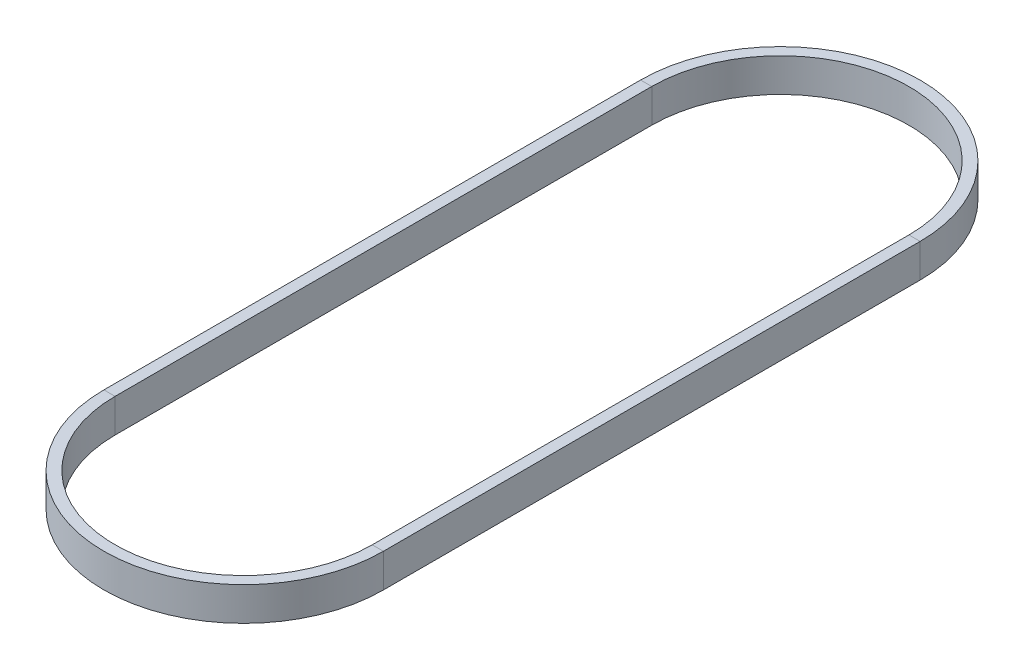
ISO-10303-21;
HEADER;
FILE_DESCRIPTION(('STEP AP214'),'2;1');
FILE_NAME('part.step','',(''),(''),'','','');
FILE_SCHEMA(('AUTOMOTIVE_DESIGN { 1 0 10303 214 1 1 1 1 }'));
ENDSEC;
DATA;
#1=APPLICATION_CONTEXT('core data for automotive mechanical design processes');
#2=APPLICATION_PROTOCOL_DEFINITION('international standard','automotive_design',2000,#1);
#3=PRODUCT_CONTEXT('',#1,'mechanical');
#4=PRODUCT('Part','Part','',(#3));
#5=PRODUCT_RELATED_PRODUCT_CATEGORY('part','',(#4));
#6=PRODUCT_DEFINITION_FORMATION('','',#4);
#7=PRODUCT_DEFINITION_CONTEXT('part definition',#1,'design');
#8=PRODUCT_DEFINITION('design','',#6,#7);
#9=PRODUCT_DEFINITION_SHAPE('','',#8);
#10=(LENGTH_UNIT() NAMED_UNIT(*) SI_UNIT(.MILLI.,.METRE.));
#11=(NAMED_UNIT(*) PLANE_ANGLE_UNIT() SI_UNIT($,.RADIAN.));
#12=(NAMED_UNIT(*) SI_UNIT($,.STERADIAN.) SOLID_ANGLE_UNIT());
#13=UNCERTAINTY_MEASURE_WITH_UNIT(LENGTH_MEASURE(1.E-05),#10,'distance_accuracy_value','');
#14=(GEOMETRIC_REPRESENTATION_CONTEXT(3) GLOBAL_UNCERTAINTY_ASSIGNED_CONTEXT((#13)) GLOBAL_UNIT_ASSIGNED_CONTEXT((#10,
#11,#12)) REPRESENTATION_CONTEXT('',''));
#15=CARTESIAN_POINT('',(0.,0.,0.));
#16=DIRECTION('',(0.,0.,1.));
#17=DIRECTION('',(1.,0.,0.));
#18=AXIS2_PLACEMENT_3D('',#15,#16,#17);
#19=CARTESIAN_POINT('',(740.522377582775,3.,330.011074688203));
#20=DIRECTION('',(0.,1.,0.));
#21=DIRECTION('',(0.,0.,1.));
#22=AXIS2_PLACEMENT_3D('',#19,#20,#21);
#23=PLANE('',#22);
#24=DIRECTION('',(0.,0.,-1.));
#25=VECTOR('',#24,1.);
#26=CARTESIAN_POINT('',(738.522377582775,3.,330.011074688203));
#27=LINE('',#26,#25);
#28=CARTESIAN_POINT('',(738.522377582775,3.,330.0110746882));
#29=VERTEX_POINT('',#28);
#30=CARTESIAN_POINT('',(738.522377582775,3.,234.011074688204));
#31=VERTEX_POINT('',#30);
#32=EDGE_CURVE('E11',#29,#31,#27,.T.);
#33=ORIENTED_EDGE('',*,*,#32,.F.);
#34=DIRECTION('',(1.,0.,0.));
#35=VECTOR('',#34,1.);
#36=CARTESIAN_POINT('',(740.522377582776,3.,330.0110746882));
#37=LINE('',#36,#35);
#38=CARTESIAN_POINT('',(740.522377582775,3.,330.0110746882));
#39=VERTEX_POINT('',#38);
#40=EDGE_CURVE('E42',#29,#39,#37,.T.);
#41=ORIENTED_EDGE('',*,*,#40,.T.);
#42=DIRECTION('',(0.,0.,-1.));
#43=VECTOR('',#42,1.);
#44=CARTESIAN_POINT('',(740.522377582775,3.,330.011074688203));
#45=LINE('',#44,#43);
#46=CARTESIAN_POINT('',(740.522377582775,3.,234.011074688204));
#47=VERTEX_POINT('',#46);
#48=EDGE_CURVE('E128',#39,#47,#45,.T.);
#49=ORIENTED_EDGE('',*,*,#48,.T.);
#50=DIRECTION('',(1.,0.,0.));
#51=VECTOR('',#50,1.);
#52=CARTESIAN_POINT('',(740.522377582775,3.,234.011074688204));
#53=LINE('',#52,#51);
#54=EDGE_CURVE('E131',#31,#47,#53,.T.);
#55=ORIENTED_EDGE('',*,*,#54,.F.);
#56=EDGE_LOOP('',(#33,#41,#49,#55));
#57=FACE_BOUND('',#56,.T.);
#58=ADVANCED_FACE('F39',(#57),#23,.T.);
#59=CARTESIAN_POINT('',(738.522377582775,3.,330.011074688203));
#60=DIRECTION('',(-1.,0.,0.));
#61=DIRECTION('',(0.,0.,1.));
#62=AXIS2_PLACEMENT_3D('',#59,#60,#61);
#63=PLANE('',#62);
#64=DIRECTION('',(0.,0.,-1.));
#65=VECTOR('',#64,1.);
#66=CARTESIAN_POINT('',(738.522377582775,-3.,330.011074688203));
#67=LINE('',#66,#65);
#68=CARTESIAN_POINT('',(738.522377582775,-3.,330.0110746882));
#69=VERTEX_POINT('',#68);
#70=CARTESIAN_POINT('',(738.522377582775,-3.,234.011074688204));
#71=VERTEX_POINT('',#70);
#72=EDGE_CURVE('E48',#69,#71,#67,.T.);
#73=ORIENTED_EDGE('',*,*,#72,.F.);
#74=DIRECTION('',(0.,1.,0.));
#75=VECTOR('',#74,1.);
#76=CARTESIAN_POINT('',(738.522377582776,3.,330.0110746882));
#77=LINE('',#76,#75);
#78=EDGE_CURVE('E218',#69,#29,#77,.T.);
#79=ORIENTED_EDGE('',*,*,#78,.T.);
#80=ORIENTED_EDGE('',*,*,#32,.T.);
#81=DIRECTION('',(0.,1.,0.));
#82=VECTOR('',#81,1.);
#83=CARTESIAN_POINT('',(738.522377582775,3.,234.011074688204));
#84=LINE('',#83,#82);
#85=EDGE_CURVE('E159',#71,#31,#84,.T.);
#86=ORIENTED_EDGE('',*,*,#85,.F.);
#87=EDGE_LOOP('',(#73,#79,#80,#86));
#88=FACE_BOUND('',#87,.T.);
#89=ADVANCED_FACE('F252',(#88),#63,.T.);
#90=CARTESIAN_POINT('',(740.522377582775,-3.,330.011074688203));
#91=DIRECTION('',(0.,-1.,0.));
#92=DIRECTION('',(0.,0.,-1.));
#93=AXIS2_PLACEMENT_3D('',#90,#91,#92);
#94=PLANE('',#93);
#95=DIRECTION('',(0.,0.,-1.));
#96=VECTOR('',#95,1.);
#97=CARTESIAN_POINT('',(740.522377582775,-3.,330.011074688203));
#98=LINE('',#97,#96);
#99=CARTESIAN_POINT('',(740.522377582775,-3.,330.0110746882));
#100=VERTEX_POINT('',#99);
#101=CARTESIAN_POINT('',(740.522377582775,-3.,234.011074688204));
#102=VERTEX_POINT('',#101);
#103=EDGE_CURVE('E138',#100,#102,#98,.T.);
#104=ORIENTED_EDGE('',*,*,#103,.F.);
#105=DIRECTION('',(-1.,0.,0.));
#106=VECTOR('',#105,1.);
#107=CARTESIAN_POINT('',(740.522377582776,-3.,330.0110746882));
#108=LINE('',#107,#106);
#109=EDGE_CURVE('E194',#100,#69,#108,.T.);
#110=ORIENTED_EDGE('',*,*,#109,.T.);
#111=ORIENTED_EDGE('',*,*,#72,.T.);
#112=DIRECTION('',(-1.,0.,0.));
#113=VECTOR('',#112,1.);
#114=CARTESIAN_POINT('',(740.522377582775,-3.,234.011074688204));
#115=LINE('',#114,#113);
#116=EDGE_CURVE('E164',#102,#71,#115,.T.);
#117=ORIENTED_EDGE('',*,*,#116,.F.);
#118=EDGE_LOOP('',(#104,#110,#111,#117));
#119=FACE_BOUND('',#118,.T.);
#120=ADVANCED_FACE('F257',(#119),#94,.T.);
#121=CARTESIAN_POINT('',(786.522377582775,3.,330.011074688204));
#122=DIRECTION('',(0.,1.,0.));
#123=DIRECTION('',(0.,0.,1.));
#124=AXIS2_PLACEMENT_3D('',#121,#122,#123);
#125=PLANE('',#124);
#126=ORIENTED_EDGE('',*,*,#40,.F.);
#127=CARTESIAN_POINT('',(763.522377582775,3.,330.011074688204));
#128=DIRECTION('',(0.,-1.,0.));
#129=DIRECTION('',(1.,0.,0.));
#130=AXIS2_PLACEMENT_3D('',#127,#128,#129);
#131=CIRCLE('',#130,25.0000000000001);
#132=CARTESIAN_POINT('',(788.522377582775,3.,330.011074688204));
#133=VERTEX_POINT('',#132);
#134=EDGE_CURVE('E84',#133,#29,#131,.T.);
#135=ORIENTED_EDGE('',*,*,#134,.F.);
#136=DIRECTION('',(-1.,0.,0.));
#137=VECTOR('',#136,1.);
#138=CARTESIAN_POINT('',(786.522377582775,3.,330.011074688204));
#139=LINE('',#138,#137);
#140=CARTESIAN_POINT('',(786.522377582775,3.,330.011074688204));
#141=VERTEX_POINT('',#140);
#142=EDGE_CURVE('E198',#133,#141,#139,.T.);
#143=ORIENTED_EDGE('',*,*,#142,.T.);
#144=CARTESIAN_POINT('',(763.522377582775,3.,330.011074688204));
#145=DIRECTION('',(0.,-1.,0.));
#146=DIRECTION('',(1.,0.,0.));
#147=AXIS2_PLACEMENT_3D('',#144,#145,#146);
#148=CIRCLE('',#147,23.0000000000001);
#149=EDGE_CURVE('E191',#141,#39,#148,.T.);
#150=ORIENTED_EDGE('',*,*,#149,.T.);
#151=EDGE_LOOP('',(#126,#135,#143,#150));
#152=FACE_BOUND('',#151,.T.);
#153=ADVANCED_FACE('F241',(#152),#125,.T.);
#154=CARTESIAN_POINT('',(763.522377582775,0.,330.011074688204));
#155=DIRECTION('',(0.,-1.,0.));
#156=DIRECTION('',(0.,0.,-1.));
#157=AXIS2_PLACEMENT_3D('',#154,#155,#156);
#158=CYLINDRICAL_SURFACE('',#157,25.0000000000001);
#159=ORIENTED_EDGE('',*,*,#134,.T.);
#160=ORIENTED_EDGE('',*,*,#78,.F.);
#161=CARTESIAN_POINT('',(763.522377582775,-3.,330.011074688204));
#162=DIRECTION('',(0.,-1.,0.));
#163=DIRECTION('',(1.,0.,0.));
#164=AXIS2_PLACEMENT_3D('',#161,#162,#163);
#165=CIRCLE('',#164,25.0000000000001);
#166=CARTESIAN_POINT('',(788.522377582775,-3.,330.011074688204));
#167=VERTEX_POINT('',#166);
#168=EDGE_CURVE('E93',#167,#69,#165,.T.);
#169=ORIENTED_EDGE('',*,*,#168,.F.);
#170=DIRECTION('',(0.,1.,0.));
#171=VECTOR('',#170,1.);
#172=CARTESIAN_POINT('',(788.522377582775,3.,330.011074688204));
#173=LINE('',#172,#171);
#174=EDGE_CURVE('E212',#167,#133,#173,.T.);
#175=ORIENTED_EDGE('',*,*,#174,.T.);
#176=EDGE_LOOP('',(#159,#160,#169,#175));
#177=FACE_BOUND('',#176,.T.);
#178=ADVANCED_FACE('F251',(#177),#158,.T.);
#179=CARTESIAN_POINT('',(786.522377582775,-3.,330.011074688204));
#180=DIRECTION('',(0.,-1.,0.));
#181=DIRECTION('',(0.,0.,-1.));
#182=AXIS2_PLACEMENT_3D('',#179,#180,#181);
#183=PLANE('',#182);
#184=ORIENTED_EDGE('',*,*,#168,.T.);
#185=ORIENTED_EDGE('',*,*,#109,.F.);
#186=CARTESIAN_POINT('',(763.522377582775,-3.,330.011074688204));
#187=DIRECTION('',(0.,-1.,0.));
#188=DIRECTION('',(1.,0.,0.));
#189=AXIS2_PLACEMENT_3D('',#186,#187,#188);
#190=CIRCLE('',#189,23.0000000000001);
#191=CARTESIAN_POINT('',(786.522377582775,-3.,330.011074688204));
#192=VERTEX_POINT('',#191);
#193=EDGE_CURVE('E101',#192,#100,#190,.T.);
#194=ORIENTED_EDGE('',*,*,#193,.F.);
#195=DIRECTION('',(1.,0.,0.));
#196=VECTOR('',#195,1.);
#197=CARTESIAN_POINT('',(786.522377582775,-3.,330.011074688204));
#198=LINE('',#197,#196);
#199=EDGE_CURVE('E183',#192,#167,#198,.T.);
#200=ORIENTED_EDGE('',*,*,#199,.T.);
#201=EDGE_LOOP('',(#184,#185,#194,#200));
#202=FACE_BOUND('',#201,.T.);
#203=ADVANCED_FACE('F258',(#202),#183,.T.);
#204=CARTESIAN_POINT('',(763.522377582775,0.,330.011074688204));
#205=DIRECTION('',(0.,-1.,0.));
#206=DIRECTION('',(0.,0.,-1.));
#207=AXIS2_PLACEMENT_3D('',#204,#205,#206);
#208=CYLINDRICAL_SURFACE('',#207,23.0000000000001);
#209=ORIENTED_EDGE('',*,*,#193,.T.);
#210=DIRECTION('',(0.,-1.,0.));
#211=VECTOR('',#210,1.);
#212=CARTESIAN_POINT('',(740.522377582776,3.,330.0110746882));
#213=LINE('',#212,#211);
#214=EDGE_CURVE('E188',#39,#100,#213,.T.);
#215=ORIENTED_EDGE('',*,*,#214,.F.);
#216=ORIENTED_EDGE('',*,*,#149,.F.);
#217=DIRECTION('',(0.,-1.,0.));
#218=VECTOR('',#217,1.);
#219=CARTESIAN_POINT('',(786.522377582775,3.,330.011074688204));
#220=LINE('',#219,#218);
#221=EDGE_CURVE('E176',#141,#192,#220,.T.);
#222=ORIENTED_EDGE('',*,*,#221,.T.);
#223=EDGE_LOOP('',(#209,#215,#216,#222));
#224=FACE_BOUND('',#223,.T.);
#225=ADVANCED_FACE('F259',(#224),#208,.F.);
#226=CARTESIAN_POINT('',(786.522377582775,3.,234.011074688204));
#227=DIRECTION('',(0.,1.,0.));
#228=DIRECTION('',(0.,0.,1.));
#229=AXIS2_PLACEMENT_3D('',#226,#227,#228);
#230=PLANE('',#229);
#231=ORIENTED_EDGE('',*,*,#142,.F.);
#232=DIRECTION('',(0.,0.,1.));
#233=VECTOR('',#232,1.);
#234=CARTESIAN_POINT('',(788.522377582775,3.,234.011074688204));
#235=LINE('',#234,#233);
#236=CARTESIAN_POINT('',(788.522377582775,3.,234.011074688204));
#237=VERTEX_POINT('',#236);
#238=EDGE_CURVE('E229',#237,#133,#235,.T.);
#239=ORIENTED_EDGE('',*,*,#238,.F.);
#240=DIRECTION('',(-1.,0.,0.));
#241=VECTOR('',#240,1.);
#242=CARTESIAN_POINT('',(786.522377582775,3.,234.011074688204));
#243=LINE('',#242,#241);
#244=CARTESIAN_POINT('',(786.522377582775,3.,234.011074688204));
#245=VERTEX_POINT('',#244);
#246=EDGE_CURVE('E187',#237,#245,#243,.T.);
#247=ORIENTED_EDGE('',*,*,#246,.T.);
#248=DIRECTION('',(0.,0.,1.));
#249=VECTOR('',#248,1.);
#250=CARTESIAN_POINT('',(786.522377582775,3.,234.011074688204));
#251=LINE('',#250,#249);
#252=EDGE_CURVE('E180',#245,#141,#251,.T.);
#253=ORIENTED_EDGE('',*,*,#252,.T.);
#254=EDGE_LOOP('',(#231,#239,#247,#253));
#255=FACE_BOUND('',#254,.T.);
#256=ADVANCED_FACE('F246',(#255),#230,.T.);
#257=CARTESIAN_POINT('',(788.522377582775,3.,234.011074688204));
#258=DIRECTION('',(1.,0.,0.));
#259=DIRECTION('',(0.,0.,-1.));
#260=AXIS2_PLACEMENT_3D('',#257,#258,#259);
#261=PLANE('',#260);
#262=ORIENTED_EDGE('',*,*,#238,.T.);
#263=ORIENTED_EDGE('',*,*,#174,.F.);
#264=DIRECTION('',(0.,0.,1.));
#265=VECTOR('',#264,1.);
#266=CARTESIAN_POINT('',(788.522377582775,-3.,234.011074688204));
#267=LINE('',#266,#265);
#268=CARTESIAN_POINT('',(788.522377582775,-3.,234.011074688204));
#269=VERTEX_POINT('',#268);
#270=EDGE_CURVE('E113',#269,#167,#267,.T.);
#271=ORIENTED_EDGE('',*,*,#270,.F.);
#272=DIRECTION('',(0.,1.,0.));
#273=VECTOR('',#272,1.);
#274=CARTESIAN_POINT('',(788.522377582775,3.,234.011074688204));
#275=LINE('',#274,#273);
#276=EDGE_CURVE('E207',#269,#237,#275,.T.);
#277=ORIENTED_EDGE('',*,*,#276,.T.);
#278=EDGE_LOOP('',(#262,#263,#271,#277));
#279=FACE_BOUND('',#278,.T.);
#280=ADVANCED_FACE('F250',(#279),#261,.T.);
#281=CARTESIAN_POINT('',(786.522377582775,-3.,234.011074688204));
#282=DIRECTION('',(0.,-1.,0.));
#283=DIRECTION('',(0.,0.,-1.));
#284=AXIS2_PLACEMENT_3D('',#281,#282,#283);
#285=PLANE('',#284);
#286=ORIENTED_EDGE('',*,*,#270,.T.);
#287=ORIENTED_EDGE('',*,*,#199,.F.);
#288=DIRECTION('',(0.,0.,1.));
#289=VECTOR('',#288,1.);
#290=CARTESIAN_POINT('',(786.522377582775,-3.,234.011074688204));
#291=LINE('',#290,#289);
#292=CARTESIAN_POINT('',(786.522377582775,-3.,234.011074688204));
#293=VERTEX_POINT('',#292);
#294=EDGE_CURVE('E119',#293,#192,#291,.T.);
#295=ORIENTED_EDGE('',*,*,#294,.F.);
#296=DIRECTION('',(1.,0.,0.));
#297=VECTOR('',#296,1.);
#298=CARTESIAN_POINT('',(786.522377582775,-3.,234.011074688204));
#299=LINE('',#298,#297);
#300=EDGE_CURVE('E174',#293,#269,#299,.T.);
#301=ORIENTED_EDGE('',*,*,#300,.T.);
#302=EDGE_LOOP('',(#286,#287,#295,#301));
#303=FACE_BOUND('',#302,.T.);
#304=ADVANCED_FACE('F312',(#303),#285,.T.);
#305=CARTESIAN_POINT('',(786.522377582775,3.,234.011074688204));
#306=DIRECTION('',(-1.,0.,0.));
#307=DIRECTION('',(0.,0.,1.));
#308=AXIS2_PLACEMENT_3D('',#305,#306,#307);
#309=PLANE('',#308);
#310=ORIENTED_EDGE('',*,*,#294,.T.);
#311=ORIENTED_EDGE('',*,*,#221,.F.);
#312=ORIENTED_EDGE('',*,*,#252,.F.);
#313=DIRECTION('',(0.,-1.,0.));
#314=VECTOR('',#313,1.);
#315=CARTESIAN_POINT('',(786.522377582775,3.,234.011074688204));
#316=LINE('',#315,#314);
#317=EDGE_CURVE('E149',#245,#293,#316,.T.);
#318=ORIENTED_EDGE('',*,*,#317,.T.);
#319=EDGE_LOOP('',(#310,#311,#312,#318));
#320=FACE_BOUND('',#319,.T.);
#321=ADVANCED_FACE('F244',(#320),#309,.T.);
#322=CARTESIAN_POINT('',(740.522377582775,3.,234.011074688204));
#323=DIRECTION('',(0.,1.,0.));
#324=DIRECTION('',(0.,0.,1.));
#325=AXIS2_PLACEMENT_3D('',#322,#323,#324);
#326=PLANE('',#325);
#327=ORIENTED_EDGE('',*,*,#246,.F.);
#328=CARTESIAN_POINT('',(763.522377582775,3.,234.011074688204));
#329=DIRECTION('',(0.,-1.,0.));
#330=DIRECTION('',(-1.,0.,0.));
#331=AXIS2_PLACEMENT_3D('',#328,#329,#330);
#332=CIRCLE('',#331,25.0000000000001);
#333=EDGE_CURVE('E157',#31,#237,#332,.T.);
#334=ORIENTED_EDGE('',*,*,#333,.F.);
#335=ORIENTED_EDGE('',*,*,#54,.T.);
#336=CARTESIAN_POINT('',(763.522377582775,3.,234.011074688204));
#337=DIRECTION('',(0.,-1.,0.));
#338=DIRECTION('',(-1.,0.,0.));
#339=AXIS2_PLACEMENT_3D('',#336,#337,#338);
#340=CIRCLE('',#339,23.0000000000001);
#341=EDGE_CURVE('E144',#47,#245,#340,.T.);
#342=ORIENTED_EDGE('',*,*,#341,.T.);
#343=EDGE_LOOP('',(#327,#334,#335,#342));
#344=FACE_BOUND('',#343,.T.);
#345=ADVANCED_FACE('F155',(#344),#326,.T.);
#346=CARTESIAN_POINT('',(763.522377582775,0.,234.011074688204));
#347=DIRECTION('',(0.,-1.,0.));
#348=DIRECTION('',(0.,0.,-1.));
#349=AXIS2_PLACEMENT_3D('',#346,#347,#348);
#350=CYLINDRICAL_SURFACE('',#349,25.0000000000001);
#351=ORIENTED_EDGE('',*,*,#333,.T.);
#352=ORIENTED_EDGE('',*,*,#276,.F.);
#353=CARTESIAN_POINT('',(763.522377582775,-3.,234.011074688204));
#354=DIRECTION('',(0.,-1.,0.));
#355=DIRECTION('',(-1.,0.,0.));
#356=AXIS2_PLACEMENT_3D('',#353,#354,#355);
#357=CIRCLE('',#356,25.0000000000001);
#358=EDGE_CURVE('E203',#71,#269,#357,.T.);
#359=ORIENTED_EDGE('',*,*,#358,.F.);
#360=ORIENTED_EDGE('',*,*,#85,.T.);
#361=EDGE_LOOP('',(#351,#352,#359,#360));
#362=FACE_BOUND('',#361,.T.);
#363=ADVANCED_FACE('F248',(#362),#350,.T.);
#364=CARTESIAN_POINT('',(740.522377582775,-3.,234.011074688204));
#365=DIRECTION('',(0.,-1.,0.));
#366=DIRECTION('',(0.,0.,-1.));
#367=AXIS2_PLACEMENT_3D('',#364,#365,#366);
#368=PLANE('',#367);
#369=ORIENTED_EDGE('',*,*,#358,.T.);
#370=ORIENTED_EDGE('',*,*,#300,.F.);
#371=CARTESIAN_POINT('',(763.522377582775,-3.,234.011074688204));
#372=DIRECTION('',(0.,-1.,0.));
#373=DIRECTION('',(-1.,0.,0.));
#374=AXIS2_PLACEMENT_3D('',#371,#372,#373);
#375=CIRCLE('',#374,23.0000000000001);
#376=EDGE_CURVE('E172',#102,#293,#375,.T.);
#377=ORIENTED_EDGE('',*,*,#376,.F.);
#378=ORIENTED_EDGE('',*,*,#116,.T.);
#379=EDGE_LOOP('',(#369,#370,#377,#378));
#380=FACE_BOUND('',#379,.T.);
#381=ADVANCED_FACE('F255',(#380),#368,.T.);
#382=CARTESIAN_POINT('',(763.522377582775,0.,234.011074688204));
#383=DIRECTION('',(0.,-1.,0.));
#384=DIRECTION('',(0.,0.,-1.));
#385=AXIS2_PLACEMENT_3D('',#382,#383,#384);
#386=CYLINDRICAL_SURFACE('',#385,23.0000000000001);
#387=ORIENTED_EDGE('',*,*,#376,.T.);
#388=ORIENTED_EDGE('',*,*,#317,.F.);
#389=ORIENTED_EDGE('',*,*,#341,.F.);
#390=DIRECTION('',(0.,-1.,0.));
#391=VECTOR('',#390,1.);
#392=CARTESIAN_POINT('',(740.522377582775,3.,234.011074688204));
#393=LINE('',#392,#391);
#394=EDGE_CURVE('E147',#47,#102,#393,.T.);
#395=ORIENTED_EDGE('',*,*,#394,.T.);
#396=EDGE_LOOP('',(#387,#388,#389,#395));
#397=FACE_BOUND('',#396,.T.);
#398=ADVANCED_FACE('F146',(#397),#386,.F.);
#399=CARTESIAN_POINT('',(740.522377582775,3.,330.011074688203));
#400=DIRECTION('',(1.,0.,0.));
#401=DIRECTION('',(0.,0.,-1.));
#402=AXIS2_PLACEMENT_3D('',#399,#400,#401);
#403=PLANE('',#402);
#404=ORIENTED_EDGE('',*,*,#214,.T.);
#405=ORIENTED_EDGE('',*,*,#103,.T.);
#406=ORIENTED_EDGE('',*,*,#394,.F.);
#407=ORIENTED_EDGE('',*,*,#48,.F.);
#408=EDGE_LOOP('',(#404,#405,#406,#407));
#409=FACE_BOUND('',#408,.T.);
#410=ADVANCED_FACE('F161',(#409),#403,.T.);
#411=CLOSED_SHELL('',(#58,#89,#120,#153,#178,#203,#225,#256,#280,#304,#321,#345,#363,#381,#398,#410));
#412=MANIFOLD_SOLID_BREP('B2',#411);
#413=ADVANCED_BREP_SHAPE_REPRESENTATION('',(#18,#412),#14);
#414=SHAPE_DEFINITION_REPRESENTATION(#9,#413);
ENDSEC;
END-ISO-10303-21;
